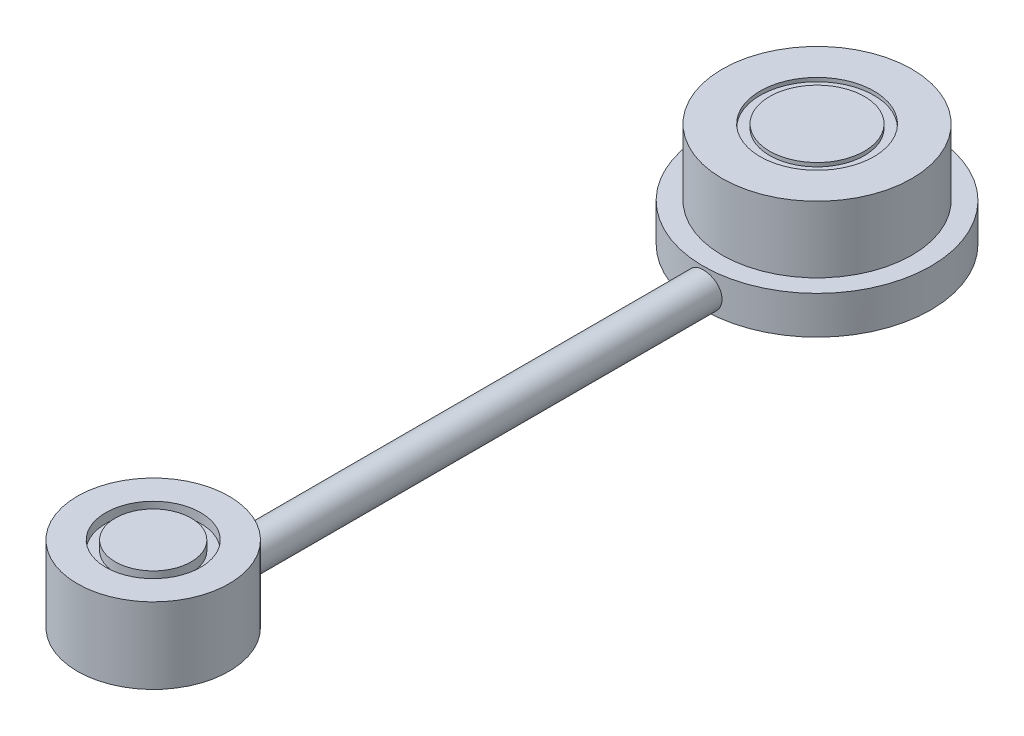
ISO-10303-21;
HEADER;
FILE_DESCRIPTION(('STEP AP214'),'2;1');
FILE_NAME('part.step','',(''),(''),'','','');
FILE_SCHEMA(('AUTOMOTIVE_DESIGN { 1 0 10303 214 1 1 1 1 }'));
ENDSEC;
DATA;
#1=APPLICATION_CONTEXT('core data for automotive mechanical design processes');
#2=APPLICATION_PROTOCOL_DEFINITION('international standard','automotive_design',2000,#1);
#3=PRODUCT_CONTEXT('',#1,'mechanical');
#4=PRODUCT('Part','Part','',(#3));
#5=PRODUCT_RELATED_PRODUCT_CATEGORY('part','',(#4));
#6=PRODUCT_DEFINITION_FORMATION('','',#4);
#7=PRODUCT_DEFINITION_CONTEXT('part definition',#1,'design');
#8=PRODUCT_DEFINITION('design','',#6,#7);
#9=PRODUCT_DEFINITION_SHAPE('','',#8);
#10=(LENGTH_UNIT() NAMED_UNIT(*) SI_UNIT(.MILLI.,.METRE.));
#11=(NAMED_UNIT(*) PLANE_ANGLE_UNIT() SI_UNIT($,.RADIAN.));
#12=(NAMED_UNIT(*) SI_UNIT($,.STERADIAN.) SOLID_ANGLE_UNIT());
#13=UNCERTAINTY_MEASURE_WITH_UNIT(LENGTH_MEASURE(1.E-05),#10,'distance_accuracy_value','');
#14=(GEOMETRIC_REPRESENTATION_CONTEXT(3) GLOBAL_UNCERTAINTY_ASSIGNED_CONTEXT((#13)) GLOBAL_UNIT_ASSIGNED_CONTEXT((#10,
#11,#12)) REPRESENTATION_CONTEXT('',''));
#15=CARTESIAN_POINT('',(0.,0.,0.));
#16=DIRECTION('',(0.,0.,1.));
#17=DIRECTION('',(1.,0.,0.));
#18=AXIS2_PLACEMENT_3D('',#15,#16,#17);
#19=CARTESIAN_POINT('',(0.,2.32456143553565,82.55));
#20=DIRECTION('',(0.,0.,-1.));
#21=DIRECTION('',(-1.,0.,0.));
#22=AXIS2_PLACEMENT_3D('',#19,#20,#21);
#23=CYLINDRICAL_SURFACE('',#22,2.33542975980873);
#24=DIRECTION('',(0.,0.,-1.));
#25=VECTOR('',#24,1.);
#26=CARTESIAN_POINT('',(0.225047318181519,0.,82.55));
#27=LINE('',#26,#25);
#28=CARTESIAN_POINT('',(0.225047318181519,0.,82.55));
#29=VERTEX_POINT('',#28);
#30=CARTESIAN_POINT('',(0.225047318181519,0.,78.7424927415936));
#31=VERTEX_POINT('',#30);
#32=EDGE_CURVE('E188',#29,#31,#27,.T.);
#33=ORIENTED_EDGE('',*,*,#32,.F.);
#34=CARTESIAN_POINT('',(0.,2.32456143553565,82.55));
#35=DIRECTION('',(0.,0.,1.));
#36=DIRECTION('',(1.,0.,0.));
#37=AXIS2_PLACEMENT_3D('',#34,#35,#36);
#38=CIRCLE('',#37,2.33542975980873);
#39=CARTESIAN_POINT('',(-0.225047318181519,0.,82.55));
#40=VERTEX_POINT('',#39);
#41=EDGE_CURVE('E185',#40,#29,#38,.T.);
#42=ORIENTED_EDGE('',*,*,#41,.F.);
#43=DIRECTION('',(0.,0.,-1.));
#44=VECTOR('',#43,1.);
#45=CARTESIAN_POINT('',(-0.225047318181519,0.,82.55));
#46=LINE('',#45,#44);
#47=CARTESIAN_POINT('',(-0.225047318181519,0.,78.7424927415936));
#48=VERTEX_POINT('',#47);
#49=EDGE_CURVE('E63',#48,#40,#46,.F.);
#50=ORIENTED_EDGE('',*,*,#49,.F.);
#51=CARTESIAN_POINT('',(0.225047318181519,0.,78.7424927415936));
#52=CARTESIAN_POINT('',(0.289894598977994,0.00627092184896367,78.7439237539793));
#53=CARTESIAN_POINT('',(0.354458882437952,0.0152674887600287,78.7459811313236));
#54=CARTESIAN_POINT('',(0.482555096195074,0.0386038925059974,78.7512651734187));
#55=CARTESIAN_POINT('',(0.546087199066791,0.0529428263311553,78.7544916405581));
#56=CARTESIAN_POINT('',(0.671569904947158,0.0868297767589968,78.7620246555155));
#57=CARTESIAN_POINT('',(0.733522974979336,0.106369042287659,78.7663293881278));
#58=CARTESIAN_POINT('',(0.855508919264208,0.150498566247245,78.775897347283));
#59=CARTESIAN_POINT('',(0.91554176024949,0.175088912131957,78.7811605904212));
#60=CARTESIAN_POINT('',(1.09212662281286,0.256173285795688,78.7981791095863));
#61=CARTESIAN_POINT('',(1.20529021926839,0.320014666289212,78.8111711206663));
#62=CARTESIAN_POINT('',(1.41929715686302,0.465370407157895,78.8390412594949));
#63=CARTESIAN_POINT('',(1.52013809030106,0.546888212690007,78.8539197546866));
#64=CARTESIAN_POINT('',(1.70848127422639,0.726890288183093,78.8842154397037));
#65=CARTESIAN_POINT('',(1.79574146924833,0.82562759339705,78.8996374499651));
#66=CARTESIAN_POINT('',(1.95253591334435,1.03649952668431,78.9290627258419));
#67=CARTESIAN_POINT('',(2.02206842716725,1.14863546468893,78.943065852491));
#68=CARTESIAN_POINT('',(2.14160598337868,1.38371055461394,78.9680876356211));
#69=CARTESIAN_POINT('',(2.19154029336102,1.50668691135178,78.9790954385652));
#70=CARTESIAN_POINT('',(2.26992565277912,1.75959458540524,78.9967344233938));
#71=CARTESIAN_POINT('',(2.29838139387957,1.88952437720509,79.0033665610357));
#72=CARTESIAN_POINT('',(2.33246653539386,2.14952890404923,79.0113447758288));
#73=CARTESIAN_POINT('',(2.33859420309577,2.27953485641454,79.0128062189308));
#74=CARTESIAN_POINT('',(2.32920244347943,2.53871257968655,79.0105895596269));
#75=CARTESIAN_POINT('',(2.31368432573131,2.66788440058322,79.0069117681445));
#76=CARTESIAN_POINT('',(2.26187497512917,2.91995492356706,78.9949404000119));
#77=CARTESIAN_POINT('',(2.22586291605672,3.04291422852356,78.9867088964303));
#78=CARTESIAN_POINT('',(2.13439236378504,3.28105267931041,78.9666144570191));
#79=CARTESIAN_POINT('',(2.07893194605867,3.39623105382709,78.9547511618177));
#80=CARTESIAN_POINT('',(1.94905737431964,3.61768257519457,78.9284794536722));
#81=CARTESIAN_POINT('',(1.87433893189349,3.72377246971927,78.9140314403272));
#82=CARTESIAN_POINT('',(1.70846348703884,3.92209121098034,78.8843204568974));
#83=CARTESIAN_POINT('',(1.61730420075354,4.01431812869313,78.8690573737959));
#84=CARTESIAN_POINT('',(1.41887005008093,4.18425281494636,78.8390524872285));
#85=CARTESIAN_POINT('',(1.31129986069241,4.26161933903149,78.8243280885593));
#86=CARTESIAN_POINT('',(1.0844013215457,4.39718487820075,78.7973911161993));
#87=CARTESIAN_POINT('',(0.965073548025787,4.45538483203052,78.7851784195007));
#88=CARTESIAN_POINT('',(0.718830437482745,4.55050253529922,78.7647137220661));
#89=CARTESIAN_POINT('',(0.591972601469121,4.58756317487511,78.7564351936262));
#90=CARTESIAN_POINT('',(0.333618175986667,4.63979192782682,78.7446564189819));
#91=CARTESIAN_POINT('',(0.202122345214535,4.65496360500353,78.7411553949441));
#92=CARTESIAN_POINT('',(-0.0585466698775834,4.66281256870043,78.7393516280827));
#93=CARTESIAN_POINT('',(-0.187704015754092,4.65599742873463,78.7409315862674));
#94=CARTESIAN_POINT('',(-0.442979990107648,4.62120996368912,78.7488582305438));
#95=CARTESIAN_POINT('',(-0.569098683016418,4.59323808762582,78.7552048154718));
#96=CARTESIAN_POINT('',(-0.81428019350662,4.51718411837912,78.7719398602557));
#97=CARTESIAN_POINT('',(-0.933368464098153,4.46918038983976,78.7823125590188));
#98=CARTESIAN_POINT('',(-1.1618667102962,4.35449853154919,78.8059980120639));
#99=CARTESIAN_POINT('',(-1.27127547097922,4.28781806195053,78.8193111346821));
#100=CARTESIAN_POINT('',(-1.47976708901538,4.1360499003337,78.8477762569762));
#101=CARTESIAN_POINT('',(-1.57858784524768,4.0506081996261,78.8629607444453));
#102=CARTESIAN_POINT('',(-1.7606486340137,3.86446451617263,78.8932896127412));
#103=CARTESIAN_POINT('',(-1.8438868916189,3.76376079736383,78.9084339888055));
#104=CARTESIAN_POINT('',(-1.99363454343584,3.54813534360648,78.9372223481702));
#105=CARTESIAN_POINT('',(-2.05987807559705,3.43302521535835,78.9508408041321));
#106=CARTESIAN_POINT('',(-2.17201690100211,3.19296223385493,78.9747166898267));
#107=CARTESIAN_POINT('',(-2.21791459756246,3.06801054517147,78.9849745164906));
#108=CARTESIAN_POINT('',(-2.28737236815442,2.81372004909373,79.0007682607433));
#109=CARTESIAN_POINT('',(-2.31124873105677,2.68447190657333,79.0063709196697));
#110=CARTESIAN_POINT('',(-2.33699944720894,2.42369075237918,79.0124211053997));
#111=CARTESIAN_POINT('',(-2.33887708002567,2.29215808421024,79.0128694006149));
#112=CARTESIAN_POINT('',(-2.32077664406631,2.0336014576822,79.0086061950535));
#113=CARTESIAN_POINT('',(-2.30127606281487,1.90654182849467,79.0040074193567));
#114=CARTESIAN_POINT('',(-2.24181247781499,1.6575579256507,78.9903684666988));
#115=CARTESIAN_POINT('',(-2.20184842439712,1.535633915772,78.9813280619063));
#116=CARTESIAN_POINT('',(-2.1024054283074,1.29956283792909,78.9597747209984));
#117=CARTESIAN_POINT('',(-2.04281927880217,1.18546274989169,78.9472427677809));
#118=CARTESIAN_POINT('',(-1.90589289562282,0.968745129412087,78.9201188675082));
#119=CARTESIAN_POINT('',(-1.82855136331447,0.866128437686081,78.9055267698033));
#120=CARTESIAN_POINT('',(-1.65610784410465,0.672674789144969,78.8754933925022));
#121=CARTESIAN_POINT('',(-1.56062401445458,0.58217982035057,78.8600401361017));
#122=CARTESIAN_POINT('',(-1.35566680092867,0.418357498682461,78.8303191942914));
#123=CARTESIAN_POINT('',(-1.2461867649495,0.345038356358966,78.8160520779851));
#124=CARTESIAN_POINT('',(-1.0154809063988,0.217302298404003,78.7902048341885));
#125=CARTESIAN_POINT('',(-0.894183078005088,0.163011890968824,78.7786428539016));
#126=CARTESIAN_POINT('',(-0.643990046328078,0.0757875973623276,78.7596587029321));
#127=CARTESIAN_POINT('',(-0.515111816133375,0.04280784264258,78.7522276457998));
#128=CARTESIAN_POINT('',(-0.358037342633725,0.0165824946128507,78.7462754274537));
#129=CARTESIAN_POINT('',(-0.331506694027152,0.0126232708510426,78.7453746019351));
#130=CARTESIAN_POINT('',(-0.278351476636033,0.00562477223951354,78.7437792062616));
#131=CARTESIAN_POINT('',(-0.251727064141044,0.00258436824543609,78.7430843829691));
#132=CARTESIAN_POINT('',(-0.22504731818152,0.,78.7424927415936));
#133=B_SPLINE_CURVE_WITH_KNOTS('',3,(#51,#52,#53,#54,#55,#56,#57,#58,#59,#60,#61,#62,#63,#64,
#65,#66,#67,#68,#69,#70,#71,#72,#73,#74,#75,#76,#77,#78,#79,#80,#81,#82,#83,#84,#85,#86,#87,#88,
#89,#90,#91,#92,#93,#94,#95,#96,#97,#98,#99,#100,#101,#102,#103,#104,#105,#106,#107,#108,#109,
#110,#111,#112,#113,#114,#115,#116,#117,#118,#119,#120,#121,#122,#123,#124,#125,#126,#127,#128,
#129,#130,#131,#132),.UNSPECIFIED.,.F.,.F.,(4,2,2,2,2,2,2,2,2,2,2,2,2,2,2,2,2,2,2,2,2,2,2,2,2,2,
2,2,2,2,2,2,2,2,2,2,2,2,2,2,4),(0.,0.195427498578262,0.390821979406734,0.585889708556303,
0.780960815369362,1.1707178711091,1.56055095936545,1.95668770018567,2.3528632014655,
2.75045568357529,3.14796129253872,3.5365399914026,3.92509518227291,4.30847990500427,
4.69190257657376,5.08180083318718,5.47175329374714,5.86980285019778,6.2678329079656,
6.66313960897184,7.05838194176441,7.4445658250146,7.83074151238636,8.21542043578941,
8.6001475738623,8.99287671898294,9.38565057083595,9.78423834266349,10.1827790194479,
10.5755020816726,10.9681665960655,11.3522362987299,11.7363257041412,12.122549427789,
12.5088014089655,12.9043273026327,13.3000418852398,13.6983394930066,14.0957769333256,
14.1762878814154,14.256699482858),.UNSPECIFIED.);
#134=EDGE_CURVE('E48',#31,#48,#133,.T.);
#135=ORIENTED_EDGE('',*,*,#134,.F.);
#136=EDGE_LOOP('',(#33,#42,#50,#135));
#137=FACE_BOUND('',#136,.T.);
#138=CARTESIAN_POINT('',(0.225047318181519,0.,6.334028324717));
#139=CARTESIAN_POINT('',(0.150125975283681,-0.00724554665179072,6.33935137902741));
#140=CARTESIAN_POINT('',(0.0751574174711317,-0.0108683199776819,6.34334387912286));
#141=CARTESIAN_POINT('',(-0.0748741279832148,-0.0108683199776652,6.34866777088385));
#142=CARTESIAN_POINT('',(-0.149937115625012,-0.00724554665177409,6.3499991625494));
#143=CARTESIAN_POINT('',(-0.225047318181519,0.,6.35));
#144=B_SPLINE_CURVE_WITH_KNOTS('',3,(#138,#139,#140,#141,#142,#143),.UNSPECIFIED.,.F.,.F.,(4,2,
4),(0.,0.225486458211327,0.450972916422135),.UNSPECIFIED.);
#145=CARTESIAN_POINT('',(0.225047318181519,0.,6.334028324717));
#146=VERTEX_POINT('',#145);
#147=CARTESIAN_POINT('',(-0.225047318181519,0.,6.35));
#148=VERTEX_POINT('',#147);
#149=EDGE_CURVE('E92',#146,#148,#144,.T.);
#150=ORIENTED_EDGE('',*,*,#149,.F.);
#151=DIRECTION('',(0.,0.,-1.));
#152=VECTOR('',#151,1.);
#153=CARTESIAN_POINT('',(0.225047318181519,0.,82.55));
#154=LINE('',#153,#152);
#155=CARTESIAN_POINT('',(0.225047318181519,0.,15.2383382855408));
#156=VERTEX_POINT('',#155);
#157=EDGE_CURVE('E80',#146,#156,#154,.F.);
#158=ORIENTED_EDGE('',*,*,#157,.T.);
#159=CARTESIAN_POINT('',(0.225047318181519,0.,15.2383382855408));
#160=CARTESIAN_POINT('',(0.290209068899004,0.00630852207674302,15.23737824706));
#161=CARTESIAN_POINT('',(0.355067242567081,0.0153548922757669,15.235999545671));
#162=CARTESIAN_POINT('',(0.483769207291385,0.0388488215516351,15.2324555089073));
#163=CARTESIAN_POINT('',(0.54761310193925,0.0532958252986699,15.2302902544119));
#164=CARTESIAN_POINT('',(0.736776661049022,0.104559459433377,15.2227005238762));
#165=CARTESIAN_POINT('',(0.859995660010404,0.14932493341682,15.2161777720084));
#166=CARTESIAN_POINT('',(1.0970776341283,0.258714021362732,15.2009270235282));
#167=CARTESIAN_POINT('',(1.21093861588088,0.323341852493801,15.1921985586696));
#168=CARTESIAN_POINT('',(1.42623326613707,0.470621732990853,15.1735012450068));
#169=CARTESIAN_POINT('',(1.52766715825302,0.553273457961497,15.1635324185281));
#170=CARTESIAN_POINT('',(1.71601391968714,0.73497710691605,15.1433798931696));
#171=CARTESIAN_POINT('',(1.80281584117654,0.834143909937757,15.1331951589662));
#172=CARTESIAN_POINT('',(1.95858709123418,1.0457233514203,15.1138253221534));
#173=CARTESIAN_POINT('',(2.02755423871611,1.15813760752072,15.1046403418874));
#174=CARTESIAN_POINT('',(2.14573718091101,1.39323232210866,15.088306496372));
#175=CARTESIAN_POINT('',(2.19492789384179,1.51592558041972,15.0811602200549));
#176=CARTESIAN_POINT('',(2.27195656070442,1.76796034322944,15.0697492738263));
#177=CARTESIAN_POINT('',(2.29979719948616,1.89730100960876,15.065484241596));
#178=CARTESIAN_POINT('',(2.33310854375936,2.15758728437993,15.0603615443483));
#179=CARTESIAN_POINT('',(2.33879908683724,2.28850411605101,15.0594703962896));
#180=CARTESIAN_POINT('',(2.32824279555952,2.54942744122336,15.0611059612106));
#181=CARTESIAN_POINT('',(2.31199632784898,2.67943394990285,15.0636326170666));
#182=CARTESIAN_POINT('',(2.2582180808334,2.93408999422333,15.0717874132609));
#183=CARTESIAN_POINT('',(2.22080694764584,3.05876562226301,15.077397969167));
#184=CARTESIAN_POINT('',(2.12589302240035,3.30007302126583,15.0910723167338));
#185=CARTESIAN_POINT('',(2.06838934613008,3.41670443795695,15.0991362163568));
#186=CARTESIAN_POINT('',(1.93442060298488,3.63958318040236,15.1168845756727));
#187=CARTESIAN_POINT('',(1.85781583803303,3.74574558052374,15.1265807958077));
#188=CARTESIAN_POINT('',(1.68800258701105,3.94378850432476,15.1464694585658));
#189=CARTESIAN_POINT('',(1.59479307529138,4.03566814512359,15.1566619318135));
#190=CARTESIAN_POINT('',(1.39341446207508,4.20337752441792,15.1765050008709));
#191=CARTESIAN_POINT('',(1.28511880981922,4.27905608507902,15.1861499234172));
#192=CARTESIAN_POINT('',(1.05722560051946,4.41114972444238,15.2037138911812));
#193=CARTESIAN_POINT('',(0.937628323404749,4.46756528010911,15.2116329791298));
#194=CARTESIAN_POINT('',(0.690927400491107,4.55931216573182,15.2248288146813));
#195=CARTESIAN_POINT('',(0.563850828922445,4.59471495281156,15.23011450758));
#196=CARTESIAN_POINT('',(0.305467470601137,4.643657785776,15.2374860821762));
#197=CARTESIAN_POINT('',(0.174160986261744,4.65719939108079,15.2395721921084));
#198=CARTESIAN_POINT('',(-0.0875092664296764,4.66197936130905,15.2403046654594));
#199=CARTESIAN_POINT('',(-0.217868821772013,4.65344592145717,15.2389862228365));
#200=CARTESIAN_POINT('',(-0.475275947427771,4.61481961692115,15.2331313656993));
#201=CARTESIAN_POINT('',(-0.602323541233823,4.58472690520585,15.2285949740173));
#202=CARTESIAN_POINT('',(-0.849372274295034,4.50393512360945,15.2168148483089));
#203=CARTESIAN_POINT('',(-0.969381971904863,4.45326170134806,15.2095744848645));
#204=CARTESIAN_POINT('',(-1.19923128938145,4.33277368696254,15.1931805963663));
#205=CARTESIAN_POINT('',(-1.30907026868315,4.26295789032217,15.1840269509295));
#206=CARTESIAN_POINT('',(-1.51660667212865,4.1053692029264,15.1647119218738));
#207=CARTESIAN_POINT('',(-1.61417615770559,4.01742889425798,15.1545416343087));
#208=CARTESIAN_POINT('',(-1.7932385788991,3.82644803070683,15.1343990012331));
#209=CARTESIAN_POINT('',(-1.87473082710294,3.72340683048506,15.1244266642026));
#210=CARTESIAN_POINT('',(-2.01978846129243,3.50440732302941,15.1057423713231));
#211=CARTESIAN_POINT('',(-2.08324602315017,3.38837687587738,15.0970381418795));
#212=CARTESIAN_POINT('',(-2.18973846243455,3.14715322541185,15.081961238624));
#213=CARTESIAN_POINT('',(-2.23277445579746,3.02196052320123,15.0755884374155));
#214=CARTESIAN_POINT('',(-2.29689303073563,2.76691759448089,15.0659528697336));
#215=CARTESIAN_POINT('',(-2.31813158147134,2.63710743319836,15.0626680221942));
#216=CARTESIAN_POINT('',(-2.33854568611366,2.37572614409223,15.0595124578151));
#217=CARTESIAN_POINT('',(-2.33772258980483,2.24415512449446,15.0596415321035));
#218=CARTESIAN_POINT('',(-2.3141517717747,1.98426003992462,15.0632810527698));
#219=CARTESIAN_POINT('',(-2.29160450623076,1.85591728931806,15.0667605831884));
#220=CARTESIAN_POINT('',(-2.22555875546441,1.60486021137673,15.0766572072744));
#221=CARTESIAN_POINT('',(-2.18205949690206,1.48214609197836,15.083074409371));
#222=CARTESIAN_POINT('',(-2.07520303327805,1.24535127009743,15.0981468329386));
#223=CARTESIAN_POINT('',(-2.01178002684233,1.13130075338134,15.1068094534419));
#224=CARTESIAN_POINT('',(-1.86692474178019,0.915404401449542,15.1253927379883));
#225=CARTESIAN_POINT('',(-1.7854930368976,0.813558177573427,15.1353133619481));
#226=CARTESIAN_POINT('',(-1.60592732629897,0.623836438112786,15.1554223243792));
#227=CARTESIAN_POINT('',(-1.50762931267583,0.536116281914903,15.1656123704009));
#228=CARTESIAN_POINT('',(-1.29757700661324,0.378338443605048,15.1850254726715));
#229=CARTESIAN_POINT('',(-1.18581545915449,0.308290347809604,15.1942480025078));
#230=CARTESIAN_POINT('',(-0.951731328397453,0.187782735135249,15.2107070841891));
#231=CARTESIAN_POINT('',(-0.829384231431117,0.137370258629109,15.2179388548458));
#232=CARTESIAN_POINT('',(-0.578017740117469,0.0579734731126261,15.2295506993095));
#233=CARTESIAN_POINT('',(-0.44901508089265,0.0289379775883335,15.2339375820873));
#234=CARTESIAN_POINT('',(-0.287506757220023,0.00668052884852114,15.2373206999324));
#235=CARTESIAN_POINT('',(-0.256302128373399,0.00302181053991273,15.2378783326728));
#236=CARTESIAN_POINT('',(-0.225047318181519,0.,15.2383382855408));
#237=B_SPLINE_CURVE_WITH_KNOTS('',3,(#159,#160,#161,#162,#163,#164,#165,#166,#167,#168,#169,
#170,#171,#172,#173,#174,#175,#176,#177,#178,#179,#180,#181,#182,#183,#184,#185,#186,#187,#188,
#189,#190,#191,#192,#193,#194,#195,#196,#197,#198,#199,#200,#201,#202,#203,#204,#205,#206,#207,
#208,#209,#210,#211,#212,#213,#214,#215,#216,#217,#218,#219,#220,#221,#222,#223,#224,#225,#226,
#227,#228,#229,#230,#231,#232,#233,#234,#235,#236),.UNSPECIFIED.,.F.,.F.,(4,2,2,2,2,2,2,2,2,2,2,
2,2,2,2,2,2,2,2,2,2,2,2,2,2,2,2,2,2,2,2,2,2,2,2,2,2,2,4),(0.,0.19629767631452,0.39257517351884,
0.784334204770687,1.17617647169089,1.56801168678776,1.96269600730244,2.35742857254962,
2.75266019631765,3.14784211010978,3.53909172759282,3.93033480599146,4.31936981247921,
4.70842194138301,5.10040748824317,5.49241725584513,5.88793930835765,6.28345156677765,
6.67761100262155,7.07174232071249,7.46181572404385,7.85188635972666,8.24147237484868,
8.63108290993895,9.02446804610689,9.41786999855736,9.81357675107686,10.2092618777167,
10.602095556725,10.9949052012804,11.3841246312146,11.7733584283741,12.1638914924838,
12.5544121162905,12.9489710467238,13.3437435500575,13.7394560632448,14.1342179458046,
14.2284589283205),.UNSPECIFIED.);
#238=CARTESIAN_POINT('',(-0.225047318181519,0.,15.2383382855408));
#239=VERTEX_POINT('',#238);
#240=EDGE_CURVE('E177',#156,#239,#237,.T.);
#241=ORIENTED_EDGE('',*,*,#240,.T.);
#242=DIRECTION('',(0.,0.,-1.));
#243=VECTOR('',#242,1.);
#244=CARTESIAN_POINT('',(-0.225047318181519,0.,82.55));
#245=LINE('',#244,#243);
#246=EDGE_CURVE('E89',#239,#148,#245,.T.);
#247=ORIENTED_EDGE('',*,*,#246,.T.);
#248=EDGE_LOOP('',(#150,#158,#241,#247));
#249=FACE_BOUND('',#248,.T.);
#250=ADVANCED_FACE('F39',(#137,#249),#23,.T.);
#251=CARTESIAN_POINT('',(0.,2.32456143553565,82.55));
#252=DIRECTION('',(0.,0.,1.));
#253=DIRECTION('',(1.,0.,0.));
#254=AXIS2_PLACEMENT_3D('',#251,#252,#253);
#255=PLANE('',#254);
#256=ORIENTED_EDGE('',*,*,#41,.T.);
#257=DIRECTION('',(-1.,0.,0.));
#258=VECTOR('',#257,1.);
#259=CARTESIAN_POINT('',(0.,0.,82.55));
#260=LINE('',#259,#258);
#261=EDGE_CURVE('E88',#29,#40,#260,.T.);
#262=ORIENTED_EDGE('',*,*,#261,.T.);
#263=EDGE_LOOP('',(#256,#262));
#264=FACE_BOUND('',#263,.T.);
#265=ADVANCED_FACE('F149',(#264),#255,.T.);
#266=CARTESIAN_POINT('',(0.,5.08,0.));
#267=DIRECTION('',(0.,-1.,0.));
#268=DIRECTION('',(0.,0.,-1.));
#269=AXIS2_PLACEMENT_3D('',#266,#267,#268);
#270=CYLINDRICAL_SURFACE('',#269,15.24);
#271=CARTESIAN_POINT('',(0.,5.08,0.));
#272=DIRECTION('',(0.,1.,0.));
#273=DIRECTION('',(0.,0.,1.));
#274=AXIS2_PLACEMENT_3D('',#271,#272,#273);
#275=CIRCLE('',#274,15.24);
#276=CARTESIAN_POINT('',(0.,5.08,15.24));
#277=VERTEX_POINT('',#276);
#278=EDGE_CURVE('E159',#277,#277,#275,.T.);
#279=ORIENTED_EDGE('',*,*,#278,.F.);
#280=EDGE_LOOP('',(#279));
#281=FACE_BOUND('',#280,.T.);
#282=ORIENTED_EDGE('',*,*,#240,.F.);
#283=CARTESIAN_POINT('',(0.,0.,0.));
#284=DIRECTION('',(0.,1.,0.));
#285=DIRECTION('',(0.,0.,1.));
#286=AXIS2_PLACEMENT_3D('',#283,#284,#285);
#287=CIRCLE('',#286,15.24);
#288=EDGE_CURVE('E84',#156,#239,#287,.T.);
#289=ORIENTED_EDGE('',*,*,#288,.T.);
#290=EDGE_LOOP('',(#282,#289));
#291=FACE_BOUND('',#290,.T.);
#292=ADVANCED_FACE('F41',(#281,#291),#270,.T.);
#293=CARTESIAN_POINT('',(0.,0.,0.));
#294=DIRECTION('',(0.,1.,0.));
#295=DIRECTION('',(0.,0.,1.));
#296=AXIS2_PLACEMENT_3D('',#293,#294,#295);
#297=PLANE('',#296);
#298=CARTESIAN_POINT('',(-0.225047318181519,0.,0.));
#299=DIRECTION('',(0.,-1.,0.));
#300=DIRECTION('',(0.,0.,-1.));
#301=AXIS2_PLACEMENT_3D('',#298,#299,#300);
#302=CIRCLE('',#301,6.35);
#303=EDGE_CURVE('E55',#148,#146,#302,.T.);
#304=ORIENTED_EDGE('',*,*,#303,.F.);
#305=ORIENTED_EDGE('',*,*,#246,.F.);
#306=ORIENTED_EDGE('',*,*,#288,.F.);
#307=ORIENTED_EDGE('',*,*,#157,.F.);
#308=EDGE_LOOP('',(#304,#305,#306,#307));
#309=FACE_BOUND('',#308,.T.);
#310=ADVANCED_FACE('F82',(#309),#297,.F.);
#311=CARTESIAN_POINT('',(0.,5.08,0.));
#312=DIRECTION('',(0.,1.,0.));
#313=DIRECTION('',(0.,0.,1.));
#314=AXIS2_PLACEMENT_3D('',#311,#312,#313);
#315=PLANE('',#314);
#316=CARTESIAN_POINT('',(0.,5.08,0.));
#317=DIRECTION('',(0.,1.,0.));
#318=DIRECTION('',(0.,0.,1.));
#319=AXIS2_PLACEMENT_3D('',#316,#317,#318);
#320=CIRCLE('',#319,12.7);
#321=CARTESIAN_POINT('',(0.,5.08,12.7));
#322=VERTEX_POINT('',#321);
#323=EDGE_CURVE('E157',#322,#322,#320,.T.);
#324=ORIENTED_EDGE('',*,*,#323,.F.);
#325=EDGE_LOOP('',(#324));
#326=FACE_BOUND('',#325,.T.);
#327=ORIENTED_EDGE('',*,*,#278,.T.);
#328=EDGE_LOOP('',(#327));
#329=FACE_BOUND('',#328,.T.);
#330=ADVANCED_FACE('F244',(#326,#329),#315,.T.);
#331=CARTESIAN_POINT('',(0.,13.97,0.));
#332=DIRECTION('',(0.,-1.,0.));
#333=DIRECTION('',(0.,0.,-1.));
#334=AXIS2_PLACEMENT_3D('',#331,#332,#333);
#335=CYLINDRICAL_SURFACE('',#334,12.7);
#336=CARTESIAN_POINT('',(0.,13.97,0.));
#337=DIRECTION('',(0.,1.,0.));
#338=DIRECTION('',(0.,0.,1.));
#339=AXIS2_PLACEMENT_3D('',#336,#337,#338);
#340=CIRCLE('',#339,12.7);
#341=CARTESIAN_POINT('',(0.,13.97,12.7));
#342=VERTEX_POINT('',#341);
#343=EDGE_CURVE('E160',#342,#342,#340,.T.);
#344=ORIENTED_EDGE('',*,*,#343,.F.);
#345=EDGE_LOOP('',(#344));
#346=FACE_BOUND('',#345,.T.);
#347=ORIENTED_EDGE('',*,*,#323,.T.);
#348=EDGE_LOOP('',(#347));
#349=FACE_BOUND('',#348,.T.);
#350=ADVANCED_FACE('F370',(#346,#349),#335,.T.);
#351=CARTESIAN_POINT('',(0.,13.97,0.));
#352=DIRECTION('',(0.,1.,0.));
#353=DIRECTION('',(0.,0.,1.));
#354=AXIS2_PLACEMENT_3D('',#351,#352,#353);
#355=PLANE('',#354);
#356=CARTESIAN_POINT('',(0.,13.97,0.));
#357=DIRECTION('',(0.,1.,0.));
#358=DIRECTION('',(0.,0.,1.));
#359=AXIS2_PLACEMENT_3D('',#356,#357,#358);
#360=CIRCLE('',#359,7.62);
#361=CARTESIAN_POINT('',(0.,13.97,7.62));
#362=VERTEX_POINT('',#361);
#363=EDGE_CURVE('E168',#362,#362,#360,.T.);
#364=ORIENTED_EDGE('',*,*,#363,.F.);
#365=EDGE_LOOP('',(#364));
#366=FACE_BOUND('',#365,.T.);
#367=ORIENTED_EDGE('',*,*,#343,.T.);
#368=EDGE_LOOP('',(#367));
#369=FACE_BOUND('',#368,.T.);
#370=ADVANCED_FACE('F335',(#366,#369),#355,.T.);
#371=CARTESIAN_POINT('',(0.,13.462,0.));
#372=DIRECTION('',(0.,1.,0.));
#373=DIRECTION('',(0.,0.,1.));
#374=AXIS2_PLACEMENT_3D('',#371,#372,#373);
#375=CYLINDRICAL_SURFACE('',#374,7.62);
#376=CARTESIAN_POINT('',(0.,13.462,0.));
#377=DIRECTION('',(0.,1.,0.));
#378=DIRECTION('',(0.,0.,1.));
#379=AXIS2_PLACEMENT_3D('',#376,#377,#378);
#380=CIRCLE('',#379,7.62);
#381=CARTESIAN_POINT('',(0.,13.462,7.62));
#382=VERTEX_POINT('',#381);
#383=EDGE_CURVE('E167',#382,#382,#380,.T.);
#384=ORIENTED_EDGE('',*,*,#383,.F.);
#385=EDGE_LOOP('',(#384));
#386=FACE_BOUND('',#385,.T.);
#387=ORIENTED_EDGE('',*,*,#363,.T.);
#388=EDGE_LOOP('',(#387));
#389=FACE_BOUND('',#388,.T.);
#390=ADVANCED_FACE('F353',(#386,#389),#375,.F.);
#391=CARTESIAN_POINT('',(0.,13.462,0.));
#392=DIRECTION('',(0.,1.,0.));
#393=DIRECTION('',(0.,0.,1.));
#394=AXIS2_PLACEMENT_3D('',#391,#392,#393);
#395=PLANE('',#394);
#396=CARTESIAN_POINT('',(0.,13.462,0.));
#397=DIRECTION('',(0.,1.,0.));
#398=DIRECTION('',(0.,0.,1.));
#399=AXIS2_PLACEMENT_3D('',#396,#397,#398);
#400=CIRCLE('',#399,6.35);
#401=CARTESIAN_POINT('',(0.,13.462,6.35));
#402=VERTEX_POINT('',#401);
#403=EDGE_CURVE('E171',#402,#402,#400,.T.);
#404=ORIENTED_EDGE('',*,*,#403,.F.);
#405=EDGE_LOOP('',(#404));
#406=FACE_BOUND('',#405,.T.);
#407=ORIENTED_EDGE('',*,*,#383,.T.);
#408=EDGE_LOOP('',(#407));
#409=FACE_BOUND('',#408,.T.);
#410=ADVANCED_FACE('F344',(#406,#409),#395,.T.);
#411=CARTESIAN_POINT('',(0.,13.462,0.));
#412=DIRECTION('',(0.,1.,0.));
#413=DIRECTION('',(0.,0.,1.));
#414=AXIS2_PLACEMENT_3D('',#411,#412,#413);
#415=CYLINDRICAL_SURFACE('',#414,6.35);
#416=ORIENTED_EDGE('',*,*,#403,.T.);
#417=EDGE_LOOP('',(#416));
#418=FACE_BOUND('',#417,.T.);
#419=CARTESIAN_POINT('',(0.,13.97,0.));
#420=DIRECTION('',(0.,1.,0.));
#421=DIRECTION('',(0.,0.,1.));
#422=AXIS2_PLACEMENT_3D('',#419,#420,#421);
#423=CIRCLE('',#422,6.35);
#424=CARTESIAN_POINT('',(0.,13.97,6.35));
#425=VERTEX_POINT('',#424);
#426=EDGE_CURVE('E174',#425,#425,#423,.T.);
#427=ORIENTED_EDGE('',*,*,#426,.F.);
#428=EDGE_LOOP('',(#427));
#429=FACE_BOUND('',#428,.T.);
#430=ADVANCED_FACE('F332',(#418,#429),#415,.T.);
#431=ORIENTED_EDGE('',*,*,#426,.T.);
#432=EDGE_LOOP('',(#431));
#433=FACE_BOUND('',#432,.T.);
#434=ADVANCED_FACE('F147',(#433),#355,.T.);
#435=CARTESIAN_POINT('',(0.,10.16,88.9));
#436=DIRECTION('',(0.,-1.,0.));
#437=DIRECTION('',(0.,0.,-1.));
#438=AXIS2_PLACEMENT_3D('',#435,#436,#437);
#439=CYLINDRICAL_SURFACE('',#438,10.16);
#440=CARTESIAN_POINT('',(0.,10.16,88.9));
#441=DIRECTION('',(0.,1.,0.));
#442=DIRECTION('',(0.,0.,1.));
#443=AXIS2_PLACEMENT_3D('',#440,#441,#442);
#444=CIRCLE('',#443,10.16);
#445=CARTESIAN_POINT('',(0.,10.16,99.06));
#446=VERTEX_POINT('',#445);
#447=EDGE_CURVE('E191',#446,#446,#444,.T.);
#448=ORIENTED_EDGE('',*,*,#447,.F.);
#449=EDGE_LOOP('',(#448));
#450=FACE_BOUND('',#449,.T.);
#451=CARTESIAN_POINT('',(0.,0.,88.9));
#452=DIRECTION('',(0.,1.,0.));
#453=DIRECTION('',(0.,0.,1.));
#454=AXIS2_PLACEMENT_3D('',#451,#452,#453);
#455=CIRCLE('',#454,10.16);
#456=EDGE_CURVE('E192',#48,#31,#455,.T.);
#457=ORIENTED_EDGE('',*,*,#456,.T.);
#458=ORIENTED_EDGE('',*,*,#134,.T.);
#459=EDGE_LOOP('',(#457,#458));
#460=FACE_BOUND('',#459,.T.);
#461=ADVANCED_FACE('F143',(#450,#460),#439,.T.);
#462=CARTESIAN_POINT('',(0.,0.,88.9));
#463=DIRECTION('',(0.,1.,0.));
#464=DIRECTION('',(0.,0.,1.));
#465=AXIS2_PLACEMENT_3D('',#462,#463,#464);
#466=PLANE('',#465);
#467=CARTESIAN_POINT('',(0.,0.,88.9));
#468=DIRECTION('',(0.,1.,0.));
#469=DIRECTION('',(0.,0.,1.));
#470=AXIS2_PLACEMENT_3D('',#467,#468,#469);
#471=CIRCLE('',#470,5.715);
#472=CARTESIAN_POINT('',(0.,0.,94.615));
#473=VERTEX_POINT('',#472);
#474=EDGE_CURVE('E11',#473,#473,#471,.F.);
#475=ORIENTED_EDGE('',*,*,#474,.F.);
#476=EDGE_LOOP('',(#475));
#477=FACE_BOUND('',#476,.T.);
#478=ORIENTED_EDGE('',*,*,#261,.F.);
#479=ORIENTED_EDGE('',*,*,#32,.T.);
#480=ORIENTED_EDGE('',*,*,#456,.F.);
#481=ORIENTED_EDGE('',*,*,#49,.T.);
#482=EDGE_LOOP('',(#478,#479,#480,#481));
#483=FACE_BOUND('',#482,.T.);
#484=ADVANCED_FACE('F139',(#477,#483),#466,.F.);
#485=CARTESIAN_POINT('',(0.,10.16,88.9));
#486=DIRECTION('',(0.,1.,0.));
#487=DIRECTION('',(0.,0.,1.));
#488=AXIS2_PLACEMENT_3D('',#485,#486,#487);
#489=PLANE('',#488);
#490=CARTESIAN_POINT('',(0.,10.16,88.9));
#491=DIRECTION('',(0.,1.,0.));
#492=DIRECTION('',(0.,0.,1.));
#493=AXIS2_PLACEMENT_3D('',#490,#491,#492);
#494=CIRCLE('',#493,6.35);
#495=CARTESIAN_POINT('',(0.,10.16,95.25));
#496=VERTEX_POINT('',#495);
#497=EDGE_CURVE('E198',#496,#496,#494,.T.);
#498=ORIENTED_EDGE('',*,*,#497,.F.);
#499=EDGE_LOOP('',(#498));
#500=FACE_BOUND('',#499,.T.);
#501=ORIENTED_EDGE('',*,*,#447,.T.);
#502=EDGE_LOOP('',(#501));
#503=FACE_BOUND('',#502,.T.);
#504=ADVANCED_FACE('F135',(#500,#503),#489,.T.);
#505=CARTESIAN_POINT('',(0.,8.89,88.9));
#506=DIRECTION('',(0.,1.,0.));
#507=DIRECTION('',(0.,0.,1.));
#508=AXIS2_PLACEMENT_3D('',#505,#506,#507);
#509=CYLINDRICAL_SURFACE('',#508,6.35);
#510=CARTESIAN_POINT('',(0.,8.89,88.9));
#511=DIRECTION('',(0.,1.,0.));
#512=DIRECTION('',(0.,0.,1.));
#513=AXIS2_PLACEMENT_3D('',#510,#511,#512);
#514=CIRCLE('',#513,6.35);
#515=CARTESIAN_POINT('',(0.,8.89,95.25));
#516=VERTEX_POINT('',#515);
#517=EDGE_CURVE('E195',#516,#516,#514,.T.);
#518=ORIENTED_EDGE('',*,*,#517,.F.);
#519=EDGE_LOOP('',(#518));
#520=FACE_BOUND('',#519,.T.);
#521=ORIENTED_EDGE('',*,*,#497,.T.);
#522=EDGE_LOOP('',(#521));
#523=FACE_BOUND('',#522,.T.);
#524=ADVANCED_FACE('F131',(#520,#523),#509,.F.);
#525=CARTESIAN_POINT('',(0.,8.89,88.9));
#526=DIRECTION('',(0.,1.,0.));
#527=DIRECTION('',(0.,0.,1.));
#528=AXIS2_PLACEMENT_3D('',#525,#526,#527);
#529=PLANE('',#528);
#530=CARTESIAN_POINT('',(0.,8.89,88.9));
#531=DIRECTION('',(0.,1.,0.));
#532=DIRECTION('',(0.,0.,1.));
#533=AXIS2_PLACEMENT_3D('',#530,#531,#532);
#534=CIRCLE('',#533,5.08);
#535=CARTESIAN_POINT('',(0.,8.89,93.98));
#536=VERTEX_POINT('',#535);
#537=EDGE_CURVE('E111',#536,#536,#534,.T.);
#538=ORIENTED_EDGE('',*,*,#537,.F.);
#539=EDGE_LOOP('',(#538));
#540=FACE_BOUND('',#539,.T.);
#541=ORIENTED_EDGE('',*,*,#517,.T.);
#542=EDGE_LOOP('',(#541));
#543=FACE_BOUND('',#542,.T.);
#544=ADVANCED_FACE('F127',(#540,#543),#529,.T.);
#545=CARTESIAN_POINT('',(0.,8.89,88.9));
#546=DIRECTION('',(0.,1.,0.));
#547=DIRECTION('',(0.,0.,1.));
#548=AXIS2_PLACEMENT_3D('',#545,#546,#547);
#549=CYLINDRICAL_SURFACE('',#548,5.08);
#550=ORIENTED_EDGE('',*,*,#537,.T.);
#551=EDGE_LOOP('',(#550));
#552=FACE_BOUND('',#551,.T.);
#553=CARTESIAN_POINT('',(0.,10.16,88.9));
#554=DIRECTION('',(0.,1.,0.));
#555=DIRECTION('',(0.,0.,1.));
#556=AXIS2_PLACEMENT_3D('',#553,#554,#555);
#557=CIRCLE('',#556,5.08);
#558=CARTESIAN_POINT('',(0.,10.16,93.98));
#559=VERTEX_POINT('',#558);
#560=EDGE_CURVE('E94',#559,#559,#557,.T.);
#561=ORIENTED_EDGE('',*,*,#560,.F.);
#562=EDGE_LOOP('',(#561));
#563=FACE_BOUND('',#562,.T.);
#564=ADVANCED_FACE('F124',(#552,#563),#549,.T.);
#565=ORIENTED_EDGE('',*,*,#560,.T.);
#566=EDGE_LOOP('',(#565));
#567=FACE_BOUND('',#566,.T.);
#568=ADVANCED_FACE('F121',(#567),#489,.T.);
#569=CARTESIAN_POINT('',(-0.225047318181519,-2.54,0.));
#570=DIRECTION('',(0.,1.,0.));
#571=DIRECTION('',(0.,0.,1.));
#572=AXIS2_PLACEMENT_3D('',#569,#570,#571);
#573=CYLINDRICAL_SURFACE('',#572,6.35);
#574=CARTESIAN_POINT('',(-0.225047318181519,-2.54,0.));
#575=DIRECTION('',(0.,-1.,0.));
#576=DIRECTION('',(0.,0.,-1.));
#577=AXIS2_PLACEMENT_3D('',#574,#575,#576);
#578=CIRCLE('',#577,6.35);
#579=CARTESIAN_POINT('',(-0.225047318181519,-2.54,-6.35));
#580=VERTEX_POINT('',#579);
#581=EDGE_CURVE('E95',#580,#580,#578,.T.);
#582=ORIENTED_EDGE('',*,*,#581,.F.);
#583=EDGE_LOOP('',(#582));
#584=FACE_BOUND('',#583,.T.);
#585=ORIENTED_EDGE('',*,*,#303,.T.);
#586=ORIENTED_EDGE('',*,*,#149,.T.);
#587=EDGE_LOOP('',(#585,#586));
#588=FACE_BOUND('',#587,.T.);
#589=ADVANCED_FACE('F97',(#584,#588),#573,.T.);
#590=CARTESIAN_POINT('',(-0.225047318181519,-2.54,0.));
#591=DIRECTION('',(0.,-1.,0.));
#592=DIRECTION('',(0.,0.,-1.));
#593=AXIS2_PLACEMENT_3D('',#590,#591,#592);
#594=PLANE('',#593);
#595=ORIENTED_EDGE('',*,*,#581,.T.);
#596=EDGE_LOOP('',(#595));
#597=FACE_BOUND('',#596,.T.);
#598=ADVANCED_FACE('F120',(#597),#594,.T.);
#599=CARTESIAN_POINT('',(0.,-1.905,88.9));
#600=DIRECTION('',(0.,1.,0.));
#601=DIRECTION('',(0.,0.,1.));
#602=AXIS2_PLACEMENT_3D('',#599,#600,#601);
#603=CYLINDRICAL_SURFACE('',#602,5.715);
#604=CARTESIAN_POINT('',(0.,-1.905,88.9));
#605=DIRECTION('',(0.,-1.,0.));
#606=DIRECTION('',(0.,0.,-1.));
#607=AXIS2_PLACEMENT_3D('',#604,#605,#606);
#608=CIRCLE('',#607,5.715);
#609=CARTESIAN_POINT('',(0.,-1.905,83.185));
#610=VERTEX_POINT('',#609);
#611=EDGE_CURVE('E98',#610,#610,#608,.T.);
#612=ORIENTED_EDGE('',*,*,#611,.F.);
#613=EDGE_LOOP('',(#612));
#614=FACE_BOUND('',#613,.T.);
#615=ORIENTED_EDGE('',*,*,#474,.T.);
#616=EDGE_LOOP('',(#615));
#617=FACE_BOUND('',#616,.T.);
#618=ADVANCED_FACE('F260',(#614,#617),#603,.T.);
#619=CARTESIAN_POINT('',(0.,-1.905,88.9));
#620=DIRECTION('',(0.,-1.,0.));
#621=DIRECTION('',(0.,0.,-1.));
#622=AXIS2_PLACEMENT_3D('',#619,#620,#621);
#623=PLANE('',#622);
#624=ORIENTED_EDGE('',*,*,#611,.T.);
#625=EDGE_LOOP('',(#624));
#626=FACE_BOUND('',#625,.T.);
#627=ADVANCED_FACE('F277',(#626),#623,.T.);
#628=CLOSED_SHELL('',(#250,#265,#292,#310,#330,#350,#370,#390,#410,#430,#434,#461,#484,#504,
#524,#544,#564,#568,#589,#598,#618,#627));
#629=MANIFOLD_SOLID_BREP('B2',#628);
#630=ADVANCED_BREP_SHAPE_REPRESENTATION('',(#18,#629),#14);
#631=SHAPE_DEFINITION_REPRESENTATION(#9,#630);
ENDSEC;
END-ISO-10303-21;
